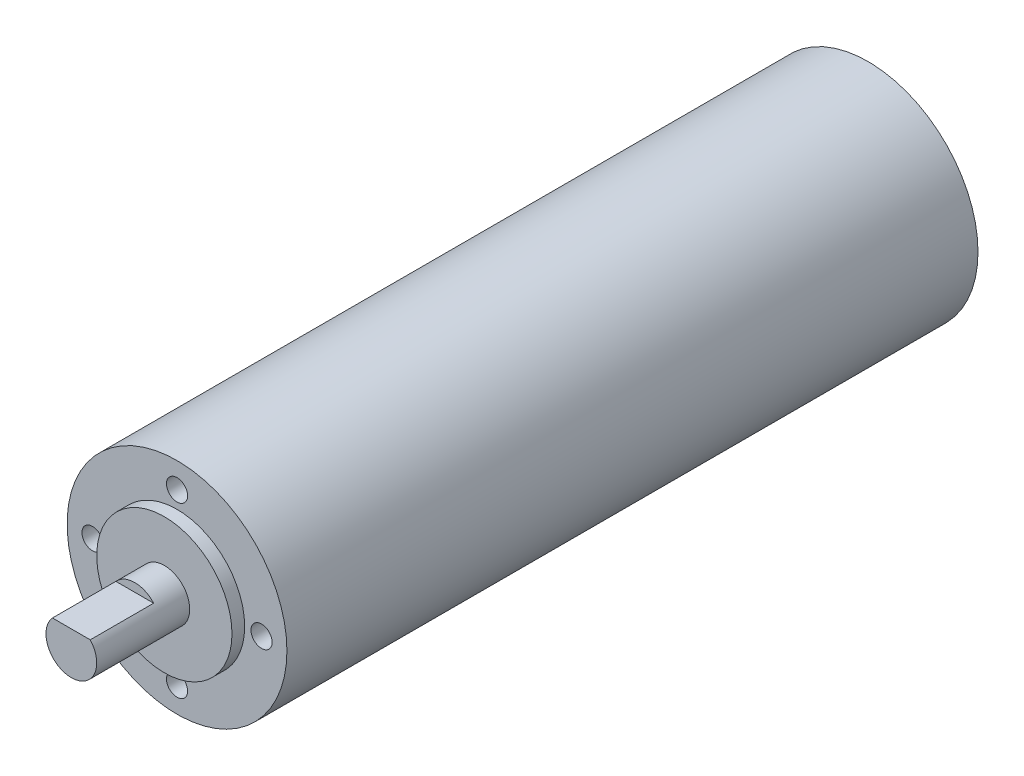
ISO-10303-21;
HEADER;
FILE_DESCRIPTION(('STEP AP214'),'2;1');
FILE_NAME('part.step','',(''),(''),'','','');
FILE_SCHEMA(('AUTOMOTIVE_DESIGN { 1 0 10303 214 1 1 1 1 }'));
ENDSEC;
DATA;
#1=APPLICATION_CONTEXT('core data for automotive mechanical design processes');
#2=APPLICATION_PROTOCOL_DEFINITION('international standard','automotive_design',2000,#1);
#3=PRODUCT_CONTEXT('',#1,'mechanical');
#4=PRODUCT('Part','Part','',(#3));
#5=PRODUCT_RELATED_PRODUCT_CATEGORY('part','',(#4));
#6=PRODUCT_DEFINITION_FORMATION('','',#4);
#7=PRODUCT_DEFINITION_CONTEXT('part definition',#1,'design');
#8=PRODUCT_DEFINITION('design','',#6,#7);
#9=PRODUCT_DEFINITION_SHAPE('','',#8);
#10=(LENGTH_UNIT() NAMED_UNIT(*) SI_UNIT(.MILLI.,.METRE.));
#11=(NAMED_UNIT(*) PLANE_ANGLE_UNIT() SI_UNIT($,.RADIAN.));
#12=(NAMED_UNIT(*) SI_UNIT($,.STERADIAN.) SOLID_ANGLE_UNIT());
#13=UNCERTAINTY_MEASURE_WITH_UNIT(LENGTH_MEASURE(1.E-05),#10,'distance_accuracy_value','');
#14=(GEOMETRIC_REPRESENTATION_CONTEXT(3) GLOBAL_UNCERTAINTY_ASSIGNED_CONTEXT((#13)) GLOBAL_UNIT_ASSIGNED_CONTEXT((#10,
#11,#12)) REPRESENTATION_CONTEXT('',''));
#15=CARTESIAN_POINT('',(0.,0.,0.));
#16=DIRECTION('',(0.,0.,1.));
#17=DIRECTION('',(1.,0.,0.));
#18=AXIS2_PLACEMENT_3D('',#15,#16,#17);
#19=CARTESIAN_POINT('',(0.,0.,166.5));
#20=DIRECTION('',(0.,0.,1.));
#21=DIRECTION('',(1.,0.,0.));
#22=AXIS2_PLACEMENT_3D('',#19,#20,#21);
#23=PLANE('',#22);
#24=CARTESIAN_POINT('',(0.,0.,166.5));
#25=DIRECTION('',(0.,0.,1.));
#26=DIRECTION('',(1.,0.,0.));
#27=AXIS2_PLACEMENT_3D('',#24,#25,#26);
#28=CIRCLE('',#27,16.);
#29=CARTESIAN_POINT('',(16.,0.,166.5));
#30=VERTEX_POINT('',#29);
#31=EDGE_CURVE('E83',#30,#30,#28,.T.);
#32=ORIENTED_EDGE('',*,*,#31,.T.);
#33=EDGE_LOOP('',(#32));
#34=FACE_BOUND('',#33,.T.);
#35=CARTESIAN_POINT('',(0.,0.,166.5));
#36=DIRECTION('',(0.,0.,1.));
#37=DIRECTION('',(1.,0.,0.));
#38=AXIS2_PLACEMENT_3D('',#35,#36,#37);
#39=CIRCLE('',#38,6.);
#40=CARTESIAN_POINT('',(6.,0.,166.5));
#41=VERTEX_POINT('',#40);
#42=EDGE_CURVE('E80',#41,#41,#39,.T.);
#43=ORIENTED_EDGE('',*,*,#42,.F.);
#44=EDGE_LOOP('',(#43));
#45=FACE_BOUND('',#44,.T.);
#46=ADVANCED_FACE('F37',(#34,#45),#23,.T.);
#47=CARTESIAN_POINT('',(0.,0.,163.5));
#48=DIRECTION('',(0.,0.,1.));
#49=DIRECTION('',(1.,0.,0.));
#50=AXIS2_PLACEMENT_3D('',#47,#48,#49);
#51=PLANE('',#50);
#52=CARTESIAN_POINT('',(-19.9999999999994,-5.6843418860808E-13,163.5));
#53=DIRECTION('',(0.,0.,1.));
#54=DIRECTION('',(1.,0.,0.));
#55=AXIS2_PLACEMENT_3D('',#52,#53,#54);
#56=CIRCLE('',#55,2.50000000000091);
#57=CARTESIAN_POINT('',(-17.4999999999985,-5.6843418860808E-13,163.5));
#58=VERTEX_POINT('',#57);
#59=EDGE_CURVE('E164',#58,#58,#56,.T.);
#60=ORIENTED_EDGE('',*,*,#59,.F.);
#61=EDGE_LOOP('',(#60));
#62=FACE_BOUND('',#61,.T.);
#63=CARTESIAN_POINT('',(1.13196979001957E-12,-20.,163.5));
#64=DIRECTION('',(0.,0.,1.));
#65=DIRECTION('',(1.,0.,0.));
#66=AXIS2_PLACEMENT_3D('',#63,#64,#65);
#67=CIRCLE('',#66,2.50000000000122);
#68=CARTESIAN_POINT('',(2.50000000000235,-20.,163.5));
#69=VERTEX_POINT('',#68);
#70=EDGE_CURVE('E163',#69,#69,#67,.T.);
#71=ORIENTED_EDGE('',*,*,#70,.F.);
#72=EDGE_LOOP('',(#71));
#73=FACE_BOUND('',#72,.T.);
#74=CARTESIAN_POINT('',(20.0000000000006,5.65984895009786E-13,163.5));
#75=DIRECTION('',(0.,0.,1.));
#76=DIRECTION('',(1.,0.,0.));
#77=AXIS2_PLACEMENT_3D('',#74,#75,#76);
#78=CIRCLE('',#77,2.50000000000044);
#79=CARTESIAN_POINT('',(22.500000000001,5.65984895009786E-13,163.5));
#80=VERTEX_POINT('',#79);
#81=EDGE_CURVE('E173',#80,#80,#78,.T.);
#82=ORIENTED_EDGE('',*,*,#81,.F.);
#83=EDGE_LOOP('',(#82));
#84=FACE_BOUND('',#83,.T.);
#85=CARTESIAN_POINT('',(0.,20.,163.5));
#86=DIRECTION('',(0.,0.,1.));
#87=DIRECTION('',(1.,0.,0.));
#88=AXIS2_PLACEMENT_3D('',#85,#86,#87);
#89=CIRCLE('',#88,2.5);
#90=CARTESIAN_POINT('',(2.5,20.,163.5));
#91=VERTEX_POINT('',#90);
#92=EDGE_CURVE('E178',#91,#91,#89,.T.);
#93=ORIENTED_EDGE('',*,*,#92,.F.);
#94=EDGE_LOOP('',(#93));
#95=FACE_BOUND('',#94,.T.);
#96=CARTESIAN_POINT('',(0.,0.,163.5));
#97=DIRECTION('',(0.,0.,1.));
#98=DIRECTION('',(1.,0.,0.));
#99=AXIS2_PLACEMENT_3D('',#96,#97,#98);
#100=CIRCLE('',#99,26.);
#101=CARTESIAN_POINT('',(26.,0.,163.5));
#102=VERTEX_POINT('',#101);
#103=EDGE_CURVE('E11',#102,#102,#100,.T.);
#104=ORIENTED_EDGE('',*,*,#103,.T.);
#105=EDGE_LOOP('',(#104));
#106=FACE_BOUND('',#105,.T.);
#107=CARTESIAN_POINT('',(0.,0.,163.5));
#108=DIRECTION('',(0.,0.,1.));
#109=DIRECTION('',(1.,0.,0.));
#110=AXIS2_PLACEMENT_3D('',#107,#108,#109);
#111=CIRCLE('',#110,16.);
#112=CARTESIAN_POINT('',(16.,0.,163.5));
#113=VERTEX_POINT('',#112);
#114=EDGE_CURVE('E79',#113,#113,#111,.T.);
#115=ORIENTED_EDGE('',*,*,#114,.F.);
#116=EDGE_LOOP('',(#115));
#117=FACE_BOUND('',#116,.T.);
#118=ADVANCED_FACE('F105',(#62,#73,#84,#95,#106,#117),#51,.T.);
#119=CARTESIAN_POINT('',(0.,0.,163.5));
#120=DIRECTION('',(0.,0.,-1.));
#121=DIRECTION('',(-1.,0.,0.));
#122=AXIS2_PLACEMENT_3D('',#119,#120,#121);
#123=CYLINDRICAL_SURFACE('',#122,26.);
#124=ORIENTED_EDGE('',*,*,#103,.F.);
#125=EDGE_LOOP('',(#124));
#126=FACE_BOUND('',#125,.T.);
#127=CARTESIAN_POINT('',(0.,0.,0.));
#128=DIRECTION('',(0.,0.,1.));
#129=DIRECTION('',(1.,0.,0.));
#130=AXIS2_PLACEMENT_3D('',#127,#128,#129);
#131=CIRCLE('',#130,26.);
#132=CARTESIAN_POINT('',(26.,0.,0.));
#133=VERTEX_POINT('',#132);
#134=EDGE_CURVE('E41',#133,#133,#131,.T.);
#135=ORIENTED_EDGE('',*,*,#134,.T.);
#136=EDGE_LOOP('',(#135));
#137=FACE_BOUND('',#136,.T.);
#138=ADVANCED_FACE('F39',(#126,#137),#123,.T.);
#139=CARTESIAN_POINT('',(0.,0.,0.));
#140=DIRECTION('',(0.,0.,1.));
#141=DIRECTION('',(1.,0.,0.));
#142=AXIS2_PLACEMENT_3D('',#139,#140,#141);
#143=PLANE('',#142);
#144=ORIENTED_EDGE('',*,*,#134,.F.);
#145=EDGE_LOOP('',(#144));
#146=FACE_BOUND('',#145,.T.);
#147=ADVANCED_FACE('F96',(#146),#143,.F.);
#148=CARTESIAN_POINT('',(0.,0.,166.5));
#149=DIRECTION('',(0.,0.,-1.));
#150=DIRECTION('',(-1.,0.,0.));
#151=AXIS2_PLACEMENT_3D('',#148,#149,#150);
#152=CYLINDRICAL_SURFACE('',#151,16.);
#153=ORIENTED_EDGE('',*,*,#31,.F.);
#154=EDGE_LOOP('',(#153));
#155=FACE_BOUND('',#154,.T.);
#156=ORIENTED_EDGE('',*,*,#114,.T.);
#157=EDGE_LOOP('',(#156));
#158=FACE_BOUND('',#157,.T.);
#159=ADVANCED_FACE('F98',(#155,#158),#152,.T.);
#160=CARTESIAN_POINT('',(0.,0.,188.5));
#161=DIRECTION('',(0.,0.,-1.));
#162=DIRECTION('',(-1.,0.,0.));
#163=AXIS2_PLACEMENT_3D('',#160,#161,#162);
#164=CYLINDRICAL_SURFACE('',#163,6.);
#165=CARTESIAN_POINT('',(0.,0.,188.5));
#166=DIRECTION('',(0.,0.,1.));
#167=DIRECTION('',(1.,0.,0.));
#168=AXIS2_PLACEMENT_3D('',#165,#166,#167);
#169=CIRCLE('',#168,6.);
#170=CARTESIAN_POINT('',(-4.47213595499958,4.,188.5));
#171=VERTEX_POINT('',#170);
#172=CARTESIAN_POINT('',(4.47213595499958,4.,188.5));
#173=VERTEX_POINT('',#172);
#174=EDGE_CURVE('E75',#171,#173,#169,.T.);
#175=ORIENTED_EDGE('',*,*,#174,.F.);
#176=DIRECTION('',(0.,0.,1.));
#177=VECTOR('',#176,1.);
#178=CARTESIAN_POINT('',(-4.47213595499958,4.,173.5));
#179=LINE('',#178,#177);
#180=CARTESIAN_POINT('',(-4.47213595499958,4.,173.5));
#181=VERTEX_POINT('',#180);
#182=EDGE_CURVE('E52',#181,#171,#179,.T.);
#183=ORIENTED_EDGE('',*,*,#182,.F.);
#184=CARTESIAN_POINT('',(0.,0.,173.5));
#185=DIRECTION('',(0.,0.,1.));
#186=DIRECTION('',(1.,0.,0.));
#187=AXIS2_PLACEMENT_3D('',#184,#185,#186);
#188=CIRCLE('',#187,6.);
#189=CARTESIAN_POINT('',(4.47213595499958,4.,173.5));
#190=VERTEX_POINT('',#189);
#191=EDGE_CURVE('E76',#190,#181,#188,.T.);
#192=ORIENTED_EDGE('',*,*,#191,.F.);
#193=DIRECTION('',(0.,0.,1.));
#194=VECTOR('',#193,1.);
#195=CARTESIAN_POINT('',(4.47213595499958,4.,173.5));
#196=LINE('',#195,#194);
#197=EDGE_CURVE('E65',#190,#173,#196,.T.);
#198=ORIENTED_EDGE('',*,*,#197,.T.);
#199=EDGE_LOOP('',(#175,#183,#192,#198));
#200=FACE_BOUND('',#199,.T.);
#201=ORIENTED_EDGE('',*,*,#42,.T.);
#202=EDGE_LOOP('',(#201));
#203=FACE_BOUND('',#202,.T.);
#204=ADVANCED_FACE('F73',(#200,#203),#164,.T.);
#205=CARTESIAN_POINT('',(0.,0.,188.5));
#206=DIRECTION('',(0.,0.,1.));
#207=DIRECTION('',(1.,0.,0.));
#208=AXIS2_PLACEMENT_3D('',#205,#206,#207);
#209=PLANE('',#208);
#210=DIRECTION('',(1.,0.,0.));
#211=VECTOR('',#210,1.);
#212=CARTESIAN_POINT('',(0.,4.,188.5));
#213=LINE('',#212,#211);
#214=EDGE_CURVE('E62',#171,#173,#213,.T.);
#215=ORIENTED_EDGE('',*,*,#214,.F.);
#216=ORIENTED_EDGE('',*,*,#174,.T.);
#217=EDGE_LOOP('',(#215,#216));
#218=FACE_BOUND('',#217,.T.);
#219=ADVANCED_FACE('F78',(#218),#209,.T.);
#220=CARTESIAN_POINT('',(0.,4.,173.5));
#221=DIRECTION('',(0.,-1.,0.));
#222=DIRECTION('',(0.,0.,-1.));
#223=AXIS2_PLACEMENT_3D('',#220,#221,#222);
#224=PLANE('',#223);
#225=ORIENTED_EDGE('',*,*,#214,.T.);
#226=ORIENTED_EDGE('',*,*,#197,.F.);
#227=DIRECTION('',(1.,0.,0.));
#228=VECTOR('',#227,1.);
#229=CARTESIAN_POINT('',(0.,4.,173.5));
#230=LINE('',#229,#228);
#231=EDGE_CURVE('E58',#181,#190,#230,.T.);
#232=ORIENTED_EDGE('',*,*,#231,.F.);
#233=ORIENTED_EDGE('',*,*,#182,.T.);
#234=EDGE_LOOP('',(#225,#226,#232,#233));
#235=FACE_BOUND('',#234,.T.);
#236=ADVANCED_FACE('F64',(#235),#224,.F.);
#237=CARTESIAN_POINT('',(0.,0.,173.5));
#238=DIRECTION('',(0.,0.,1.));
#239=DIRECTION('',(1.,0.,0.));
#240=AXIS2_PLACEMENT_3D('',#237,#238,#239);
#241=PLANE('',#240);
#242=ORIENTED_EDGE('',*,*,#231,.T.);
#243=ORIENTED_EDGE('',*,*,#191,.T.);
#244=EDGE_LOOP('',(#242,#243));
#245=FACE_BOUND('',#244,.T.);
#246=ADVANCED_FACE('F123',(#245),#241,.T.);
#247=CARTESIAN_POINT('',(0.,20.,153.5));
#248=DIRECTION('',(0.,0.,1.));
#249=DIRECTION('',(1.,0.,0.));
#250=AXIS2_PLACEMENT_3D('',#247,#248,#249);
#251=CYLINDRICAL_SURFACE('',#250,2.5);
#252=CARTESIAN_POINT('',(0.,20.,153.5));
#253=DIRECTION('',(0.,0.,1.));
#254=DIRECTION('',(1.,0.,0.));
#255=AXIS2_PLACEMENT_3D('',#252,#253,#254);
#256=CIRCLE('',#255,2.5);
#257=CARTESIAN_POINT('',(2.5,20.,153.5));
#258=VERTEX_POINT('',#257);
#259=EDGE_CURVE('E69',#258,#258,#256,.T.);
#260=ORIENTED_EDGE('',*,*,#259,.F.);
#261=EDGE_LOOP('',(#260));
#262=FACE_BOUND('',#261,.T.);
#263=ORIENTED_EDGE('',*,*,#92,.T.);
#264=EDGE_LOOP('',(#263));
#265=FACE_BOUND('',#264,.T.);
#266=ADVANCED_FACE('F126',(#262,#265),#251,.F.);
#267=CARTESIAN_POINT('',(0.,20.,153.5));
#268=DIRECTION('',(0.,0.,1.));
#269=DIRECTION('',(1.,0.,0.));
#270=AXIS2_PLACEMENT_3D('',#267,#268,#269);
#271=PLANE('',#270);
#272=ORIENTED_EDGE('',*,*,#259,.T.);
#273=EDGE_LOOP('',(#272));
#274=FACE_BOUND('',#273,.T.);
#275=ADVANCED_FACE('F130',(#274),#271,.T.);
#276=CARTESIAN_POINT('',(20.0000000000006,5.65984895009786E-13,153.5));
#277=DIRECTION('',(0.,0.,1.));
#278=DIRECTION('',(1.,0.,0.));
#279=AXIS2_PLACEMENT_3D('',#276,#277,#278);
#280=CYLINDRICAL_SURFACE('',#279,2.50000000000044);
#281=CARTESIAN_POINT('',(20.0000000000006,5.65984895009786E-13,153.5));
#282=DIRECTION('',(0.,0.,1.));
#283=DIRECTION('',(1.,0.,0.));
#284=AXIS2_PLACEMENT_3D('',#281,#282,#283);
#285=CIRCLE('',#284,2.50000000000044);
#286=CARTESIAN_POINT('',(22.500000000001,5.65984895009786E-13,153.5));
#287=VERTEX_POINT('',#286);
#288=EDGE_CURVE('E175',#287,#287,#285,.T.);
#289=ORIENTED_EDGE('',*,*,#288,.F.);
#290=EDGE_LOOP('',(#289));
#291=FACE_BOUND('',#290,.T.);
#292=ORIENTED_EDGE('',*,*,#81,.T.);
#293=EDGE_LOOP('',(#292));
#294=FACE_BOUND('',#293,.T.);
#295=ADVANCED_FACE('F134',(#291,#294),#280,.F.);
#296=CARTESIAN_POINT('',(20.0000000000006,5.65984895009786E-13,153.5));
#297=DIRECTION('',(0.,0.,1.));
#298=DIRECTION('',(1.,0.,0.));
#299=AXIS2_PLACEMENT_3D('',#296,#297,#298);
#300=PLANE('',#299);
#301=ORIENTED_EDGE('',*,*,#288,.T.);
#302=EDGE_LOOP('',(#301));
#303=FACE_BOUND('',#302,.T.);
#304=ADVANCED_FACE('F138',(#303),#300,.T.);
#305=CARTESIAN_POINT('',(1.13196979001957E-12,-20.,153.5));
#306=DIRECTION('',(0.,0.,1.));
#307=DIRECTION('',(1.,0.,0.));
#308=AXIS2_PLACEMENT_3D('',#305,#306,#307);
#309=CYLINDRICAL_SURFACE('',#308,2.50000000000122);
#310=CARTESIAN_POINT('',(1.13196979001957E-12,-20.,153.5));
#311=DIRECTION('',(0.,0.,1.));
#312=DIRECTION('',(1.,0.,0.));
#313=AXIS2_PLACEMENT_3D('',#310,#311,#312);
#314=CIRCLE('',#313,2.50000000000122);
#315=CARTESIAN_POINT('',(2.50000000000235,-20.,153.5));
#316=VERTEX_POINT('',#315);
#317=EDGE_CURVE('E167',#316,#316,#314,.T.);
#318=ORIENTED_EDGE('',*,*,#317,.F.);
#319=EDGE_LOOP('',(#318));
#320=FACE_BOUND('',#319,.T.);
#321=ORIENTED_EDGE('',*,*,#70,.T.);
#322=EDGE_LOOP('',(#321));
#323=FACE_BOUND('',#322,.T.);
#324=ADVANCED_FACE('F142',(#320,#323),#309,.F.);
#325=CARTESIAN_POINT('',(1.13196979001957E-12,-20.,153.5));
#326=DIRECTION('',(0.,0.,1.));
#327=DIRECTION('',(1.,0.,0.));
#328=AXIS2_PLACEMENT_3D('',#325,#326,#327);
#329=PLANE('',#328);
#330=ORIENTED_EDGE('',*,*,#317,.T.);
#331=EDGE_LOOP('',(#330));
#332=FACE_BOUND('',#331,.T.);
#333=ADVANCED_FACE('F146',(#332),#329,.T.);
#334=CARTESIAN_POINT('',(-19.9999999999994,-5.6843418860808E-13,153.5));
#335=DIRECTION('',(0.,0.,1.));
#336=DIRECTION('',(1.,0.,0.));
#337=AXIS2_PLACEMENT_3D('',#334,#335,#336);
#338=CYLINDRICAL_SURFACE('',#337,2.50000000000091);
#339=CARTESIAN_POINT('',(-19.9999999999994,-5.6843418860808E-13,153.5));
#340=DIRECTION('',(0.,0.,1.));
#341=DIRECTION('',(1.,0.,0.));
#342=AXIS2_PLACEMENT_3D('',#339,#340,#341);
#343=CIRCLE('',#342,2.50000000000091);
#344=CARTESIAN_POINT('',(-17.4999999999985,-5.6843418860808E-13,153.5));
#345=VERTEX_POINT('',#344);
#346=EDGE_CURVE('E162',#345,#345,#343,.T.);
#347=ORIENTED_EDGE('',*,*,#346,.F.);
#348=EDGE_LOOP('',(#347));
#349=FACE_BOUND('',#348,.T.);
#350=ORIENTED_EDGE('',*,*,#59,.T.);
#351=EDGE_LOOP('',(#350));
#352=FACE_BOUND('',#351,.T.);
#353=ADVANCED_FACE('F150',(#349,#352),#338,.F.);
#354=CARTESIAN_POINT('',(-19.9999999999994,-5.6843418860808E-13,153.5));
#355=DIRECTION('',(0.,0.,1.));
#356=DIRECTION('',(1.,0.,0.));
#357=AXIS2_PLACEMENT_3D('',#354,#355,#356);
#358=PLANE('',#357);
#359=ORIENTED_EDGE('',*,*,#346,.T.);
#360=EDGE_LOOP('',(#359));
#361=FACE_BOUND('',#360,.T.);
#362=ADVANCED_FACE('F154',(#361),#358,.T.);
#363=CLOSED_SHELL('',(#46,#118,#138,#147,#159,#204,#219,#236,#246,#266,#275,#295,#304,#324,#333,
#353,#362));
#364=MANIFOLD_SOLID_BREP('B2',#363);
#365=ADVANCED_BREP_SHAPE_REPRESENTATION('',(#18,#364),#14);
#366=SHAPE_DEFINITION_REPRESENTATION(#9,#365);
ENDSEC;
END-ISO-10303-21;
